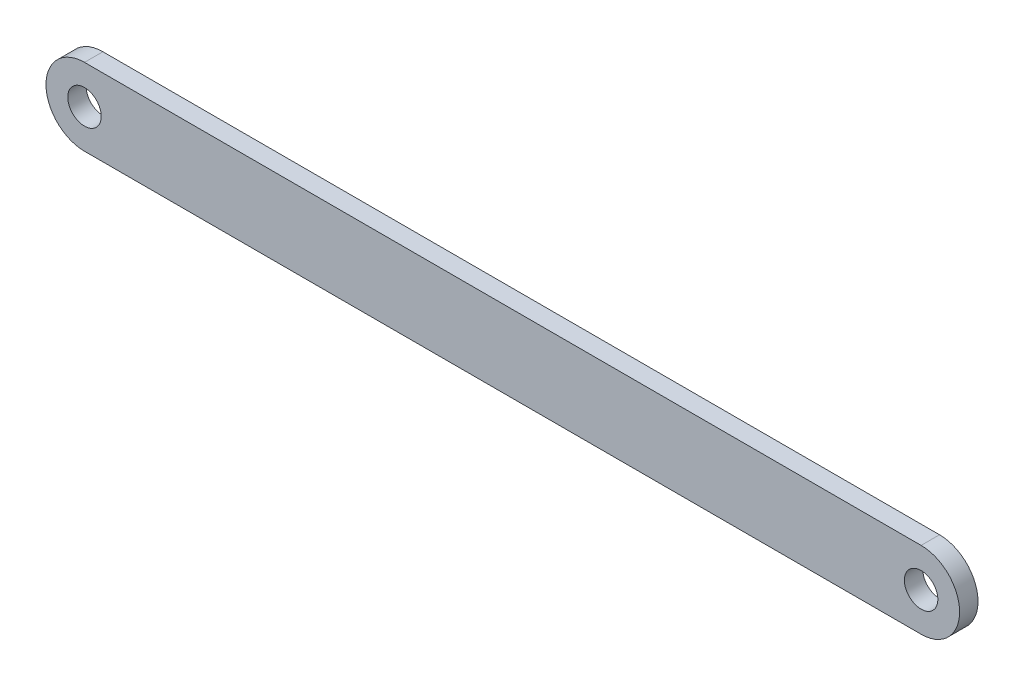
ISO-10303-21;
HEADER;
FILE_DESCRIPTION(('STEP AP214'),'2;1');
FILE_NAME('part.step','',(''),(''),'','','');
FILE_SCHEMA(('AUTOMOTIVE_DESIGN { 1 0 10303 214 1 1 1 1 }'));
ENDSEC;
DATA;
#1=APPLICATION_CONTEXT('core data for automotive mechanical design processes');
#2=APPLICATION_PROTOCOL_DEFINITION('international standard','automotive_design',2000,#1);
#3=PRODUCT_CONTEXT('',#1,'mechanical');
#4=PRODUCT('Part','Part','',(#3));
#5=PRODUCT_RELATED_PRODUCT_CATEGORY('part','',(#4));
#6=PRODUCT_DEFINITION_FORMATION('','',#4);
#7=PRODUCT_DEFINITION_CONTEXT('part definition',#1,'design');
#8=PRODUCT_DEFINITION('design','',#6,#7);
#9=PRODUCT_DEFINITION_SHAPE('','',#8);
#10=(LENGTH_UNIT() NAMED_UNIT(*) SI_UNIT(.MILLI.,.METRE.));
#11=(NAMED_UNIT(*) PLANE_ANGLE_UNIT() SI_UNIT($,.RADIAN.));
#12=(NAMED_UNIT(*) SI_UNIT($,.STERADIAN.) SOLID_ANGLE_UNIT());
#13=UNCERTAINTY_MEASURE_WITH_UNIT(LENGTH_MEASURE(1.E-05),#10,'distance_accuracy_value','');
#14=(GEOMETRIC_REPRESENTATION_CONTEXT(3) GLOBAL_UNCERTAINTY_ASSIGNED_CONTEXT((#13)) GLOBAL_UNIT_ASSIGNED_CONTEXT((#10,
#11,#12)) REPRESENTATION_CONTEXT('',''));
#15=CARTESIAN_POINT('',(0.,0.,0.));
#16=DIRECTION('',(0.,0.,1.));
#17=DIRECTION('',(1.,0.,0.));
#18=AXIS2_PLACEMENT_3D('',#15,#16,#17);
#19=CARTESIAN_POINT('',(-125.,0.,2.75));
#20=DIRECTION('',(0.,0.,1.));
#21=DIRECTION('',(1.,0.,0.));
#22=AXIS2_PLACEMENT_3D('',#19,#20,#21);
#23=PLANE('',#22);
#24=CARTESIAN_POINT('',(-125.,0.,2.75));
#25=DIRECTION('',(0.,0.,1.));
#26=DIRECTION('',(1.,0.,0.));
#27=AXIS2_PLACEMENT_3D('',#24,#25,#26);
#28=CIRCLE('',#27,4.99999999999999);
#29=CARTESIAN_POINT('',(-120.,0.,2.75));
#30=VERTEX_POINT('',#29);
#31=EDGE_CURVE('E102',#30,#30,#28,.T.);
#32=ORIENTED_EDGE('',*,*,#31,.F.);
#33=EDGE_LOOP('',(#32));
#34=FACE_BOUND('',#33,.T.);
#35=CARTESIAN_POINT('',(-125.,0.,2.75));
#36=DIRECTION('',(0.,0.,1.));
#37=DIRECTION('',(1.,0.,0.));
#38=AXIS2_PLACEMENT_3D('',#35,#36,#37);
#39=CIRCLE('',#38,11.5);
#40=CARTESIAN_POINT('',(-125.,11.5,2.75));
#41=VERTEX_POINT('',#40);
#42=CARTESIAN_POINT('',(-125.,-11.5,2.75));
#43=VERTEX_POINT('',#42);
#44=EDGE_CURVE('E87',#41,#43,#39,.T.);
#45=ORIENTED_EDGE('',*,*,#44,.T.);
#46=DIRECTION('',(1.,0.,0.));
#47=VECTOR('',#46,1.);
#48=CARTESIAN_POINT('',(-125.,-11.5,2.75));
#49=LINE('',#48,#47);
#50=CARTESIAN_POINT('',(125.,-11.5,2.75));
#51=VERTEX_POINT('',#50);
#52=EDGE_CURVE('E82',#43,#51,#49,.T.);
#53=ORIENTED_EDGE('',*,*,#52,.T.);
#54=CARTESIAN_POINT('',(125.,0.,2.75));
#55=DIRECTION('',(0.,0.,1.));
#56=DIRECTION('',(1.,0.,0.));
#57=AXIS2_PLACEMENT_3D('',#54,#55,#56);
#58=CIRCLE('',#57,11.5);
#59=CARTESIAN_POINT('',(125.,11.5,2.75));
#60=VERTEX_POINT('',#59);
#61=EDGE_CURVE('E85',#51,#60,#58,.T.);
#62=ORIENTED_EDGE('',*,*,#61,.T.);
#63=DIRECTION('',(-1.,0.,0.));
#64=VECTOR('',#63,1.);
#65=CARTESIAN_POINT('',(-125.,11.5,2.75));
#66=LINE('',#65,#64);
#67=EDGE_CURVE('E52',#60,#41,#66,.T.);
#68=ORIENTED_EDGE('',*,*,#67,.T.);
#69=EDGE_LOOP('',(#45,#53,#62,#68));
#70=FACE_BOUND('',#69,.T.);
#71=CARTESIAN_POINT('',(125.,0.,2.75));
#72=DIRECTION('',(0.,0.,1.));
#73=DIRECTION('',(1.,0.,0.));
#74=AXIS2_PLACEMENT_3D('',#71,#72,#73);
#75=CIRCLE('',#74,4.99999999999999);
#76=CARTESIAN_POINT('',(130.,0.,2.75));
#77=VERTEX_POINT('',#76);
#78=EDGE_CURVE('E117',#77,#77,#75,.T.);
#79=ORIENTED_EDGE('',*,*,#78,.F.);
#80=EDGE_LOOP('',(#79));
#81=FACE_BOUND('',#80,.T.);
#82=ADVANCED_FACE('F35',(#34,#70,#81),#23,.T.);
#83=CARTESIAN_POINT('',(-125.,0.,-2.75));
#84=DIRECTION('',(0.,0.,1.));
#85=DIRECTION('',(1.,0.,0.));
#86=AXIS2_PLACEMENT_3D('',#83,#84,#85);
#87=PLANE('',#86);
#88=CARTESIAN_POINT('',(-125.,0.,-2.75));
#89=DIRECTION('',(0.,0.,1.));
#90=DIRECTION('',(1.,0.,0.));
#91=AXIS2_PLACEMENT_3D('',#88,#89,#90);
#92=CIRCLE('',#91,11.5);
#93=CARTESIAN_POINT('',(-125.,11.5,-2.75));
#94=VERTEX_POINT('',#93);
#95=CARTESIAN_POINT('',(-125.,-11.5,-2.75));
#96=VERTEX_POINT('',#95);
#97=EDGE_CURVE('E99',#94,#96,#92,.T.);
#98=ORIENTED_EDGE('',*,*,#97,.F.);
#99=DIRECTION('',(-1.,0.,0.));
#100=VECTOR('',#99,1.);
#101=CARTESIAN_POINT('',(-125.,11.5,-2.75));
#102=LINE('',#101,#100);
#103=CARTESIAN_POINT('',(125.,11.5,-2.75));
#104=VERTEX_POINT('',#103);
#105=EDGE_CURVE('E75',#104,#94,#102,.T.);
#106=ORIENTED_EDGE('',*,*,#105,.F.);
#107=CARTESIAN_POINT('',(125.,0.,-2.75));
#108=DIRECTION('',(0.,0.,1.));
#109=DIRECTION('',(1.,0.,0.));
#110=AXIS2_PLACEMENT_3D('',#107,#108,#109);
#111=CIRCLE('',#110,11.5);
#112=CARTESIAN_POINT('',(125.,-11.5,-2.75));
#113=VERTEX_POINT('',#112);
#114=EDGE_CURVE('E69',#113,#104,#111,.T.);
#115=ORIENTED_EDGE('',*,*,#114,.F.);
#116=DIRECTION('',(1.,0.,0.));
#117=VECTOR('',#116,1.);
#118=CARTESIAN_POINT('',(-125.,-11.5,-2.75));
#119=LINE('',#118,#117);
#120=EDGE_CURVE('E91',#96,#113,#119,.T.);
#121=ORIENTED_EDGE('',*,*,#120,.F.);
#122=EDGE_LOOP('',(#98,#106,#115,#121));
#123=FACE_BOUND('',#122,.T.);
#124=CARTESIAN_POINT('',(-125.,0.,-2.75));
#125=DIRECTION('',(0.,0.,1.));
#126=DIRECTION('',(1.,0.,0.));
#127=AXIS2_PLACEMENT_3D('',#124,#125,#126);
#128=CIRCLE('',#127,4.99999999999999);
#129=CARTESIAN_POINT('',(-120.,0.,-2.75));
#130=VERTEX_POINT('',#129);
#131=EDGE_CURVE('E114',#130,#130,#128,.T.);
#132=ORIENTED_EDGE('',*,*,#131,.T.);
#133=EDGE_LOOP('',(#132));
#134=FACE_BOUND('',#133,.T.);
#135=CARTESIAN_POINT('',(125.,0.,-2.75));
#136=DIRECTION('',(0.,0.,1.));
#137=DIRECTION('',(1.,0.,0.));
#138=AXIS2_PLACEMENT_3D('',#135,#136,#137);
#139=CIRCLE('',#138,4.99999999999999);
#140=CARTESIAN_POINT('',(130.,0.,-2.75));
#141=VERTEX_POINT('',#140);
#142=EDGE_CURVE('E120',#141,#141,#139,.T.);
#143=ORIENTED_EDGE('',*,*,#142,.T.);
#144=EDGE_LOOP('',(#143));
#145=FACE_BOUND('',#144,.T.);
#146=ADVANCED_FACE('F110',(#123,#134,#145),#87,.F.);
#147=CARTESIAN_POINT('',(-125.,0.,2.75));
#148=DIRECTION('',(0.,0.,-1.));
#149=DIRECTION('',(-1.,0.,0.));
#150=AXIS2_PLACEMENT_3D('',#147,#148,#149);
#151=CYLINDRICAL_SURFACE('',#150,11.5);
#152=ORIENTED_EDGE('',*,*,#97,.T.);
#153=DIRECTION('',(0.,0.,-1.));
#154=VECTOR('',#153,1.);
#155=CARTESIAN_POINT('',(-125.,-11.5,2.75));
#156=LINE('',#155,#154);
#157=EDGE_CURVE('E11',#43,#96,#156,.T.);
#158=ORIENTED_EDGE('',*,*,#157,.F.);
#159=ORIENTED_EDGE('',*,*,#44,.F.);
#160=DIRECTION('',(0.,0.,-1.));
#161=VECTOR('',#160,1.);
#162=CARTESIAN_POINT('',(-125.,11.5,2.75));
#163=LINE('',#162,#161);
#164=EDGE_CURVE('E95',#41,#94,#163,.T.);
#165=ORIENTED_EDGE('',*,*,#164,.T.);
#166=EDGE_LOOP('',(#152,#158,#159,#165));
#167=FACE_BOUND('',#166,.T.);
#168=ADVANCED_FACE('F37',(#167),#151,.T.);
#169=CARTESIAN_POINT('',(-125.,-11.5,2.75));
#170=DIRECTION('',(0.,1.,0.));
#171=DIRECTION('',(0.,0.,1.));
#172=AXIS2_PLACEMENT_3D('',#169,#170,#171);
#173=PLANE('',#172);
#174=ORIENTED_EDGE('',*,*,#120,.T.);
#175=DIRECTION('',(0.,0.,-1.));
#176=VECTOR('',#175,1.);
#177=CARTESIAN_POINT('',(125.,-11.5,2.75));
#178=LINE('',#177,#176);
#179=EDGE_CURVE('E44',#51,#113,#178,.T.);
#180=ORIENTED_EDGE('',*,*,#179,.F.);
#181=ORIENTED_EDGE('',*,*,#52,.F.);
#182=ORIENTED_EDGE('',*,*,#157,.T.);
#183=EDGE_LOOP('',(#174,#180,#181,#182));
#184=FACE_BOUND('',#183,.T.);
#185=ADVANCED_FACE('F90',(#184),#173,.F.);
#186=CARTESIAN_POINT('',(125.,0.,2.75));
#187=DIRECTION('',(0.,0.,-1.));
#188=DIRECTION('',(-1.,0.,0.));
#189=AXIS2_PLACEMENT_3D('',#186,#187,#188);
#190=CYLINDRICAL_SURFACE('',#189,11.5);
#191=ORIENTED_EDGE('',*,*,#114,.T.);
#192=DIRECTION('',(0.,0.,-1.));
#193=VECTOR('',#192,1.);
#194=CARTESIAN_POINT('',(125.,11.5,2.75));
#195=LINE('',#194,#193);
#196=EDGE_CURVE('E92',#60,#104,#195,.T.);
#197=ORIENTED_EDGE('',*,*,#196,.F.);
#198=ORIENTED_EDGE('',*,*,#61,.F.);
#199=ORIENTED_EDGE('',*,*,#179,.T.);
#200=EDGE_LOOP('',(#191,#197,#198,#199));
#201=FACE_BOUND('',#200,.T.);
#202=ADVANCED_FACE('F93',(#201),#190,.T.);
#203=CARTESIAN_POINT('',(-125.,11.5,2.75));
#204=DIRECTION('',(0.,-1.,0.));
#205=DIRECTION('',(0.,0.,-1.));
#206=AXIS2_PLACEMENT_3D('',#203,#204,#205);
#207=PLANE('',#206);
#208=ORIENTED_EDGE('',*,*,#105,.T.);
#209=ORIENTED_EDGE('',*,*,#164,.F.);
#210=ORIENTED_EDGE('',*,*,#67,.F.);
#211=ORIENTED_EDGE('',*,*,#196,.T.);
#212=EDGE_LOOP('',(#208,#209,#210,#211));
#213=FACE_BOUND('',#212,.T.);
#214=ADVANCED_FACE('F107',(#213),#207,.F.);
#215=CARTESIAN_POINT('',(-125.,0.,2.75));
#216=DIRECTION('',(0.,0.,-1.));
#217=DIRECTION('',(-1.,0.,0.));
#218=AXIS2_PLACEMENT_3D('',#215,#216,#217);
#219=CYLINDRICAL_SURFACE('',#218,4.99999999999999);
#220=ORIENTED_EDGE('',*,*,#31,.T.);
#221=EDGE_LOOP('',(#220));
#222=FACE_BOUND('',#221,.T.);
#223=ORIENTED_EDGE('',*,*,#131,.F.);
#224=EDGE_LOOP('',(#223));
#225=FACE_BOUND('',#224,.T.);
#226=ADVANCED_FACE('F137',(#222,#225),#219,.F.);
#227=CARTESIAN_POINT('',(125.,0.,2.75));
#228=DIRECTION('',(0.,0.,-1.));
#229=DIRECTION('',(-1.,0.,0.));
#230=AXIS2_PLACEMENT_3D('',#227,#228,#229);
#231=CYLINDRICAL_SURFACE('',#230,4.99999999999999);
#232=ORIENTED_EDGE('',*,*,#78,.T.);
#233=EDGE_LOOP('',(#232));
#234=FACE_BOUND('',#233,.T.);
#235=ORIENTED_EDGE('',*,*,#142,.F.);
#236=EDGE_LOOP('',(#235));
#237=FACE_BOUND('',#236,.T.);
#238=ADVANCED_FACE('F126',(#234,#237),#231,.F.);
#239=CLOSED_SHELL('',(#82,#146,#168,#185,#202,#214,#226,#238));
#240=MANIFOLD_SOLID_BREP('B2',#239);
#241=ADVANCED_BREP_SHAPE_REPRESENTATION('',(#18,#240),#14);
#242=SHAPE_DEFINITION_REPRESENTATION(#9,#241);
ENDSEC;
END-ISO-10303-21;
